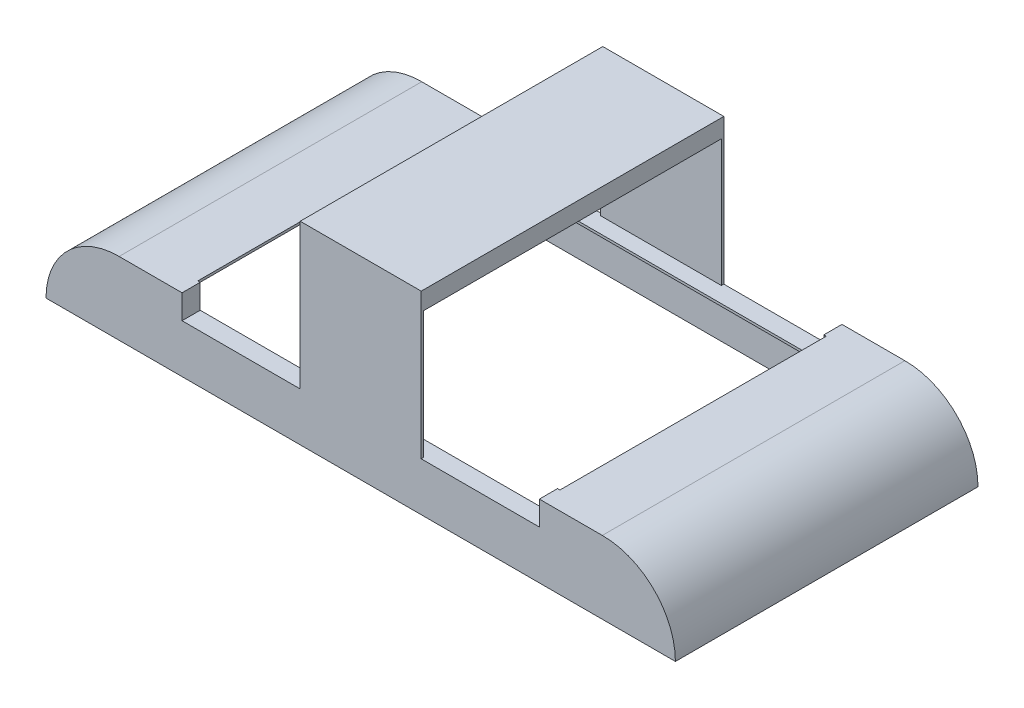
ISO-10303-21;
HEADER;
FILE_DESCRIPTION(('STEP AP214'),'2;1');
FILE_NAME('part.step','',(''),(''),'','','');
FILE_SCHEMA(('AUTOMOTIVE_DESIGN { 1 0 10303 214 1 1 1 1 }'));
ENDSEC;
DATA;
#1=APPLICATION_CONTEXT('core data for automotive mechanical design processes');
#2=APPLICATION_PROTOCOL_DEFINITION('international standard','automotive_design',2000,#1);
#3=PRODUCT_CONTEXT('',#1,'mechanical');
#4=PRODUCT('Part','Part','',(#3));
#5=PRODUCT_RELATED_PRODUCT_CATEGORY('part','',(#4));
#6=PRODUCT_DEFINITION_FORMATION('','',#4);
#7=PRODUCT_DEFINITION_CONTEXT('part definition',#1,'design');
#8=PRODUCT_DEFINITION('design','',#6,#7);
#9=PRODUCT_DEFINITION_SHAPE('','',#8);
#10=(LENGTH_UNIT() NAMED_UNIT(*) SI_UNIT(.MILLI.,.METRE.));
#11=(NAMED_UNIT(*) PLANE_ANGLE_UNIT() SI_UNIT($,.RADIAN.));
#12=(NAMED_UNIT(*) SI_UNIT($,.STERADIAN.) SOLID_ANGLE_UNIT());
#13=UNCERTAINTY_MEASURE_WITH_UNIT(LENGTH_MEASURE(1.E-05),#10,'distance_accuracy_value','');
#14=(GEOMETRIC_REPRESENTATION_CONTEXT(3) GLOBAL_UNCERTAINTY_ASSIGNED_CONTEXT((#13)) GLOBAL_UNIT_ASSIGNED_CONTEXT((#10,
#11,#12)) REPRESENTATION_CONTEXT('',''));
#15=CARTESIAN_POINT('',(0.,0.,0.));
#16=DIRECTION('',(0.,0.,1.));
#17=DIRECTION('',(1.,0.,0.));
#18=AXIS2_PLACEMENT_3D('',#15,#16,#17);
#19=CARTESIAN_POINT('',(110.397345428987,0.,15.));
#20=DIRECTION('',(-1.,0.,0.));
#21=DIRECTION('',(0.,0.,1.));
#22=AXIS2_PLACEMENT_3D('',#19,#20,#21);
#23=PLANE('',#22);
#24=DIRECTION('',(0.,1.,0.));
#25=VECTOR('',#24,1.);
#26=CARTESIAN_POINT('',(110.397345428987,60.,235.));
#27=LINE('',#26,#25);
#28=CARTESIAN_POINT('',(110.397345428987,58.,235.));
#29=VERTEX_POINT('',#28);
#30=CARTESIAN_POINT('',(110.397345428987,60.,235.));
#31=VERTEX_POINT('',#30);
#32=EDGE_CURVE('E284',#29,#31,#27,.T.);
#33=ORIENTED_EDGE('',*,*,#32,.F.);
#34=DIRECTION('',(0.,0.,1.));
#35=VECTOR('',#34,1.);
#36=CARTESIAN_POINT('',(110.397345428987,58.,15.));
#37=LINE('',#36,#35);
#38=CARTESIAN_POINT('',(110.397345428987,58.,15.));
#39=VERTEX_POINT('',#38);
#40=EDGE_CURVE('E404',#39,#29,#37,.T.);
#41=ORIENTED_EDGE('',*,*,#40,.F.);
#42=DIRECTION('',(0.,-1.,0.));
#43=VECTOR('',#42,1.);
#44=CARTESIAN_POINT('',(110.397345428987,40.,15.));
#45=LINE('',#44,#43);
#46=CARTESIAN_POINT('',(110.397345428987,60.,15.));
#47=VERTEX_POINT('',#46);
#48=EDGE_CURVE('E313',#47,#39,#45,.T.);
#49=ORIENTED_EDGE('',*,*,#48,.F.);
#50=DIRECTION('',(0.,0.,1.));
#51=VECTOR('',#50,1.);
#52=CARTESIAN_POINT('',(110.397345428987,60.,15.));
#53=LINE('',#52,#51);
#54=EDGE_CURVE('E440',#47,#31,#53,.T.);
#55=ORIENTED_EDGE('',*,*,#54,.T.);
#56=EDGE_LOOP('',(#33,#41,#49,#55));
#57=FACE_BOUND('',#56,.T.);
#58=ADVANCED_FACE('F33',(#57),#23,.F.);
#59=CARTESIAN_POINT('',(0.,40.,0.));
#60=DIRECTION('',(0.,1.,0.));
#61=DIRECTION('',(0.,0.,1.));
#62=AXIS2_PLACEMENT_3D('',#59,#60,#61);
#63=PLANE('',#62);
#64=DIRECTION('',(0.,0.,1.));
#65=VECTOR('',#64,1.);
#66=CARTESIAN_POINT('',(310.,40.,0.));
#67=LINE('',#66,#65);
#68=CARTESIAN_POINT('',(310.,40.,0.));
#69=VERTEX_POINT('',#68);
#70=CARTESIAN_POINT('',(310.,40.,1.99999999999999));
#71=VERTEX_POINT('',#70);
#72=EDGE_CURVE('E292',#69,#71,#67,.T.);
#73=ORIENTED_EDGE('',*,*,#72,.T.);
#74=DIRECTION('',(1.,0.,0.));
#75=VECTOR('',#74,1.);
#76=CARTESIAN_POINT('',(210.,40.,1.99999999999999));
#77=LINE('',#76,#75);
#78=CARTESIAN_POINT('',(210.,40.,1.99999999999999));
#79=VERTEX_POINT('',#78);
#80=EDGE_CURVE('E267',#79,#71,#77,.T.);
#81=ORIENTED_EDGE('',*,*,#80,.F.);
#82=DIRECTION('',(0.,0.,1.));
#83=VECTOR('',#82,1.);
#84=CARTESIAN_POINT('',(210.,40.,0.));
#85=LINE('',#84,#83);
#86=CARTESIAN_POINT('',(210.,40.,0.));
#87=VERTEX_POINT('',#86);
#88=EDGE_CURVE('E280',#87,#79,#85,.T.);
#89=ORIENTED_EDGE('',*,*,#88,.F.);
#90=DIRECTION('',(-1.,0.,0.));
#91=VECTOR('',#90,1.);
#92=CARTESIAN_POINT('',(409.602654571013,40.,0.));
#93=LINE('',#92,#91);
#94=CARTESIAN_POINT('',(112.397345428987,40.,0.));
#95=VERTEX_POINT('',#94);
#96=EDGE_CURVE('E430',#87,#95,#93,.T.);
#97=ORIENTED_EDGE('',*,*,#96,.T.);
#98=DIRECTION('',(0.,0.,-1.));
#99=VECTOR('',#98,1.);
#100=CARTESIAN_POINT('',(112.397345428987,40.,15.));
#101=LINE('',#100,#99);
#102=CARTESIAN_POINT('',(112.397345428987,40.,15.));
#103=VERTEX_POINT('',#102);
#104=EDGE_CURVE('E316',#103,#95,#101,.T.);
#105=ORIENTED_EDGE('',*,*,#104,.F.);
#106=DIRECTION('',(1.,0.,0.));
#107=VECTOR('',#106,1.);
#108=CARTESIAN_POINT('',(409.602654571013,40.,15.));
#109=LINE('',#108,#107);
#110=CARTESIAN_POINT('',(407.602654571013,40.,15.));
#111=VERTEX_POINT('',#110);
#112=EDGE_CURVE('E442',#103,#111,#109,.T.);
#113=ORIENTED_EDGE('',*,*,#112,.T.);
#114=DIRECTION('',(0.,0.,1.));
#115=VECTOR('',#114,1.);
#116=CARTESIAN_POINT('',(407.602654571013,40.,0.));
#117=LINE('',#116,#115);
#118=CARTESIAN_POINT('',(407.602654571013,40.,0.));
#119=VERTEX_POINT('',#118);
#120=EDGE_CURVE('E347',#119,#111,#117,.T.);
#121=ORIENTED_EDGE('',*,*,#120,.F.);
#122=EDGE_CURVE('E58',#119,#69,#93,.T.);
#123=ORIENTED_EDGE('',*,*,#122,.T.);
#124=EDGE_LOOP('',(#73,#81,#89,#97,#105,#113,#121,#123));
#125=FACE_BOUND('',#124,.T.);
#126=ADVANCED_FACE('F530',(#125),#63,.T.);
#127=CARTESIAN_POINT('',(409.602654571013,0.,15.));
#128=DIRECTION('',(1.,0.,0.));
#129=DIRECTION('',(0.,0.,-1.));
#130=AXIS2_PLACEMENT_3D('',#127,#128,#129);
#131=PLANE('',#130);
#132=DIRECTION('',(0.,-1.,0.));
#133=VECTOR('',#132,1.);
#134=CARTESIAN_POINT('',(409.602654571013,60.,235.));
#135=LINE('',#134,#133);
#136=CARTESIAN_POINT('',(409.602654571013,60.,235.));
#137=VERTEX_POINT('',#136);
#138=CARTESIAN_POINT('',(409.602654571013,58.,235.));
#139=VERTEX_POINT('',#138);
#140=EDGE_CURVE('E328',#137,#139,#135,.T.);
#141=ORIENTED_EDGE('',*,*,#140,.F.);
#142=DIRECTION('',(0.,0.,-1.));
#143=VECTOR('',#142,1.);
#144=CARTESIAN_POINT('',(409.602654571013,60.,15.));
#145=LINE('',#144,#143);
#146=CARTESIAN_POINT('',(409.602654571013,60.,15.));
#147=VERTEX_POINT('',#146);
#148=EDGE_CURVE('E445',#137,#147,#145,.T.);
#149=ORIENTED_EDGE('',*,*,#148,.T.);
#150=DIRECTION('',(0.,1.,0.));
#151=VECTOR('',#150,1.);
#152=CARTESIAN_POINT('',(409.602654571013,60.,15.));
#153=LINE('',#152,#151);
#154=CARTESIAN_POINT('',(409.602654571013,58.,15.));
#155=VERTEX_POINT('',#154);
#156=EDGE_CURVE('E343',#155,#147,#153,.T.);
#157=ORIENTED_EDGE('',*,*,#156,.F.);
#158=DIRECTION('',(0.,0.,-1.));
#159=VECTOR('',#158,1.);
#160=CARTESIAN_POINT('',(409.602654571013,58.,15.));
#161=LINE('',#160,#159);
#162=EDGE_CURVE('E403',#139,#155,#161,.T.);
#163=ORIENTED_EDGE('',*,*,#162,.F.);
#164=EDGE_LOOP('',(#141,#149,#157,#163));
#165=FACE_BOUND('',#164,.T.);
#166=ADVANCED_FACE('F650',(#165),#131,.F.);
#167=CARTESIAN_POINT('',(0.,40.,0.));
#168=DIRECTION('',(0.,1.,0.));
#169=DIRECTION('',(0.,0.,1.));
#170=AXIS2_PLACEMENT_3D('',#167,#168,#169);
#171=PLANE('',#170);
#172=DIRECTION('',(-1.,0.,0.));
#173=VECTOR('',#172,1.);
#174=CARTESIAN_POINT('',(110.397345428987,40.,235.));
#175=LINE('',#174,#173);
#176=CARTESIAN_POINT('',(407.602654571013,40.,235.));
#177=VERTEX_POINT('',#176);
#178=CARTESIAN_POINT('',(112.397345428987,40.,235.));
#179=VERTEX_POINT('',#178);
#180=EDGE_CURVE('E437',#177,#179,#175,.T.);
#181=ORIENTED_EDGE('',*,*,#180,.T.);
#182=DIRECTION('',(0.,0.,-1.));
#183=VECTOR('',#182,1.);
#184=CARTESIAN_POINT('',(112.397345428987,40.,250.));
#185=LINE('',#184,#183);
#186=CARTESIAN_POINT('',(112.397345428987,40.,250.));
#187=VERTEX_POINT('',#186);
#188=EDGE_CURVE('E298',#187,#179,#185,.T.);
#189=ORIENTED_EDGE('',*,*,#188,.F.);
#190=DIRECTION('',(1.,0.,0.));
#191=VECTOR('',#190,1.);
#192=CARTESIAN_POINT('',(110.397345428987,40.,250.));
#193=LINE('',#192,#191);
#194=CARTESIAN_POINT('',(210.,40.,250.));
#195=VERTEX_POINT('',#194);
#196=EDGE_CURVE('E278',#187,#195,#193,.T.);
#197=ORIENTED_EDGE('',*,*,#196,.T.);
#198=CARTESIAN_POINT('',(210.,40.,248.));
#199=VERTEX_POINT('',#198);
#200=EDGE_CURVE('E50',#199,#195,#85,.T.);
#201=ORIENTED_EDGE('',*,*,#200,.F.);
#202=DIRECTION('',(1.,0.,0.));
#203=VECTOR('',#202,1.);
#204=CARTESIAN_POINT('',(210.,40.,248.));
#205=LINE('',#204,#203);
#206=CARTESIAN_POINT('',(310.,40.,248.));
#207=VERTEX_POINT('',#206);
#208=EDGE_CURVE('E259',#199,#207,#205,.T.);
#209=ORIENTED_EDGE('',*,*,#208,.T.);
#210=CARTESIAN_POINT('',(310.,40.,250.));
#211=VERTEX_POINT('',#210);
#212=EDGE_CURVE('E294',#207,#211,#67,.T.);
#213=ORIENTED_EDGE('',*,*,#212,.T.);
#214=CARTESIAN_POINT('',(407.602654571013,40.,250.));
#215=VERTEX_POINT('',#214);
#216=EDGE_CURVE('E438',#211,#215,#193,.T.);
#217=ORIENTED_EDGE('',*,*,#216,.T.);
#218=DIRECTION('',(0.,0.,1.));
#219=VECTOR('',#218,1.);
#220=CARTESIAN_POINT('',(407.602654571013,40.,250.));
#221=LINE('',#220,#219);
#222=EDGE_CURVE('E336',#177,#215,#221,.T.);
#223=ORIENTED_EDGE('',*,*,#222,.F.);
#224=EDGE_LOOP('',(#181,#189,#197,#201,#209,#213,#217,#223));
#225=FACE_BOUND('',#224,.T.);
#226=ADVANCED_FACE('F276',(#225),#171,.T.);
#227=CARTESIAN_POINT('',(0.,0.,250.));
#228=DIRECTION('',(0.,1.,0.));
#229=DIRECTION('',(0.,0.,1.));
#230=AXIS2_PLACEMENT_3D('',#227,#228,#229);
#231=PLANE('',#230);
#232=DIRECTION('',(1.,0.,0.));
#233=VECTOR('',#232,1.);
#234=CARTESIAN_POINT('',(0.,0.,0.));
#235=LINE('',#234,#233);
#236=CARTESIAN_POINT('',(0.,0.,0.));
#237=VERTEX_POINT('',#236);
#238=CARTESIAN_POINT('',(520.,0.,0.));
#239=VERTEX_POINT('',#238);
#240=EDGE_CURVE('E471',#237,#239,#235,.T.);
#241=ORIENTED_EDGE('',*,*,#240,.T.);
#242=DIRECTION('',(0.,0.,-1.));
#243=VECTOR('',#242,1.);
#244=CARTESIAN_POINT('',(520.,0.,250.));
#245=LINE('',#244,#243);
#246=CARTESIAN_POINT('',(520.,0.,250.));
#247=VERTEX_POINT('',#246);
#248=EDGE_CURVE('E481',#247,#239,#245,.T.);
#249=ORIENTED_EDGE('',*,*,#248,.F.);
#250=DIRECTION('',(1.,0.,0.));
#251=VECTOR('',#250,1.);
#252=CARTESIAN_POINT('',(0.,0.,250.));
#253=LINE('',#252,#251);
#254=CARTESIAN_POINT('',(0.,0.,250.));
#255=VERTEX_POINT('',#254);
#256=EDGE_CURVE('E460',#255,#247,#253,.T.);
#257=ORIENTED_EDGE('',*,*,#256,.F.);
#258=DIRECTION('',(0.,0.,-1.));
#259=VECTOR('',#258,1.);
#260=CARTESIAN_POINT('',(0.,0.,250.));
#261=LINE('',#260,#259);
#262=EDGE_CURVE('E37',#255,#237,#261,.T.);
#263=ORIENTED_EDGE('',*,*,#262,.T.);
#264=EDGE_LOOP('',(#241,#249,#257,#263));
#265=FACE_BOUND('',#264,.T.);
#266=DIRECTION('',(1.,0.,0.));
#267=VECTOR('',#266,1.);
#268=CARTESIAN_POINT('',(60.001307039149,0.,2.));
#269=LINE('',#268,#267);
#270=CARTESIAN_POINT('',(2.,0.,2.));
#271=VERTEX_POINT('',#270);
#272=CARTESIAN_POINT('',(518.,0.,2.));
#273=VERTEX_POINT('',#272);
#274=EDGE_CURVE('E378',#271,#273,#269,.T.);
#275=ORIENTED_EDGE('',*,*,#274,.F.);
#276=DIRECTION('',(0.,0.,-1.));
#277=VECTOR('',#276,1.);
#278=CARTESIAN_POINT('',(2.,0.,248.));
#279=LINE('',#278,#277);
#280=CARTESIAN_POINT('',(2.,0.,248.));
#281=VERTEX_POINT('',#280);
#282=EDGE_CURVE('E428',#281,#271,#279,.T.);
#283=ORIENTED_EDGE('',*,*,#282,.F.);
#284=DIRECTION('',(1.,0.,0.));
#285=VECTOR('',#284,1.);
#286=CARTESIAN_POINT('',(60.001307039149,0.,248.));
#287=LINE('',#286,#285);
#288=CARTESIAN_POINT('',(518.,0.,248.));
#289=VERTEX_POINT('',#288);
#290=EDGE_CURVE('E382',#281,#289,#287,.T.);
#291=ORIENTED_EDGE('',*,*,#290,.T.);
#292=DIRECTION('',(0.,0.,-1.));
#293=VECTOR('',#292,1.);
#294=CARTESIAN_POINT('',(518.,0.,248.));
#295=LINE('',#294,#293);
#296=EDGE_CURVE('E394',#289,#273,#295,.T.);
#297=ORIENTED_EDGE('',*,*,#296,.T.);
#298=EDGE_LOOP('',(#275,#283,#291,#297));
#299=FACE_BOUND('',#298,.T.);
#300=ADVANCED_FACE('F490',(#265,#299),#231,.F.);
#301=CARTESIAN_POINT('',(459.602654571013,60.,250.));
#302=DIRECTION('',(0.,-1.,0.));
#303=DIRECTION('',(0.,0.,-1.));
#304=AXIS2_PLACEMENT_3D('',#301,#302,#303);
#305=PLANE('',#304);
#306=DIRECTION('',(-1.,0.,0.));
#307=VECTOR('',#306,1.);
#308=CARTESIAN_POINT('',(459.602654571013,60.,250.));
#309=LINE('',#308,#307);
#310=CARTESIAN_POINT('',(112.397345428987,60.,250.));
#311=VERTEX_POINT('',#310);
#312=CARTESIAN_POINT('',(60.3973454289868,60.,250.));
#313=VERTEX_POINT('',#312);
#314=EDGE_CURVE('E465',#311,#313,#309,.T.);
#315=ORIENTED_EDGE('',*,*,#314,.F.);
#316=DIRECTION('',(0.,0.,1.));
#317=VECTOR('',#316,1.);
#318=CARTESIAN_POINT('',(112.397345428987,60.,250.));
#319=LINE('',#318,#317);
#320=CARTESIAN_POINT('',(112.397345428987,60.,235.));
#321=VERTEX_POINT('',#320);
#322=EDGE_CURVE('E303',#321,#311,#319,.T.);
#323=ORIENTED_EDGE('',*,*,#322,.F.);
#324=DIRECTION('',(-1.,0.,0.));
#325=VECTOR('',#324,1.);
#326=CARTESIAN_POINT('',(112.397345428987,60.,235.));
#327=LINE('',#326,#325);
#328=EDGE_CURVE('E306',#321,#31,#327,.T.);
#329=ORIENTED_EDGE('',*,*,#328,.T.);
#330=ORIENTED_EDGE('',*,*,#54,.F.);
#331=DIRECTION('',(-1.,0.,0.));
#332=VECTOR('',#331,1.);
#333=CARTESIAN_POINT('',(112.397345428987,60.,15.));
#334=LINE('',#333,#332);
#335=CARTESIAN_POINT('',(112.397345428987,60.,15.));
#336=VERTEX_POINT('',#335);
#337=EDGE_CURVE('E324',#336,#47,#334,.T.);
#338=ORIENTED_EDGE('',*,*,#337,.F.);
#339=DIRECTION('',(0.,0.,1.));
#340=VECTOR('',#339,1.);
#341=CARTESIAN_POINT('',(112.397345428987,60.,15.));
#342=LINE('',#341,#340);
#343=CARTESIAN_POINT('',(112.397345428987,60.,0.));
#344=VERTEX_POINT('',#343);
#345=EDGE_CURVE('E322',#344,#336,#342,.T.);
#346=ORIENTED_EDGE('',*,*,#345,.F.);
#347=DIRECTION('',(-1.,0.,0.));
#348=VECTOR('',#347,1.);
#349=CARTESIAN_POINT('',(459.602654571013,60.,0.));
#350=LINE('',#349,#348);
#351=CARTESIAN_POINT('',(60.3973454289868,60.,0.));
#352=VERTEX_POINT('',#351);
#353=EDGE_CURVE('E475',#344,#352,#350,.T.);
#354=ORIENTED_EDGE('',*,*,#353,.T.);
#355=DIRECTION('',(0.,0.,-1.));
#356=VECTOR('',#355,1.);
#357=CARTESIAN_POINT('',(60.3973454289868,60.,250.));
#358=LINE('',#357,#356);
#359=EDGE_CURVE('E468',#313,#352,#358,.T.);
#360=ORIENTED_EDGE('',*,*,#359,.F.);
#361=EDGE_LOOP('',(#315,#323,#329,#330,#338,#346,#354,#360));
#362=FACE_BOUND('',#361,.T.);
#363=ADVANCED_FACE('F517',(#362),#305,.F.);
#364=CARTESIAN_POINT('',(110.397345428987,0.,15.));
#365=DIRECTION('',(0.,0.,-1.));
#366=DIRECTION('',(-1.,0.,0.));
#367=AXIS2_PLACEMENT_3D('',#364,#365,#366);
#368=PLANE('',#367);
#369=DIRECTION('',(0.,1.,0.));
#370=VECTOR('',#369,1.);
#371=CARTESIAN_POINT('',(110.397345428987,0.,15.));
#372=LINE('',#371,#370);
#373=CARTESIAN_POINT('',(110.397345428987,38.,15.));
#374=VERTEX_POINT('',#373);
#375=EDGE_CURVE('E448',#374,#39,#372,.T.);
#376=ORIENTED_EDGE('',*,*,#375,.F.);
#377=DIRECTION('',(1.,0.,0.));
#378=VECTOR('',#377,1.);
#379=CARTESIAN_POINT('',(110.397345428987,38.,15.));
#380=LINE('',#379,#378);
#381=CARTESIAN_POINT('',(409.602654571013,38.,15.));
#382=VERTEX_POINT('',#381);
#383=EDGE_CURVE('E408',#374,#382,#380,.T.);
#384=ORIENTED_EDGE('',*,*,#383,.T.);
#385=DIRECTION('',(0.,1.,0.));
#386=VECTOR('',#385,1.);
#387=CARTESIAN_POINT('',(409.602654571013,0.,15.));
#388=LINE('',#387,#386);
#389=EDGE_CURVE('E451',#382,#155,#388,.T.);
#390=ORIENTED_EDGE('',*,*,#389,.T.);
#391=ORIENTED_EDGE('',*,*,#156,.T.);
#392=DIRECTION('',(1.,0.,0.));
#393=VECTOR('',#392,1.);
#394=CARTESIAN_POINT('',(407.602654571013,60.,15.));
#395=LINE('',#394,#393);
#396=CARTESIAN_POINT('',(407.602654571013,60.,15.));
#397=VERTEX_POINT('',#396);
#398=EDGE_CURVE('E355',#397,#147,#395,.T.);
#399=ORIENTED_EDGE('',*,*,#398,.F.);
#400=DIRECTION('',(0.,1.,0.));
#401=VECTOR('',#400,1.);
#402=CARTESIAN_POINT('',(407.602654571013,60.,15.));
#403=LINE('',#402,#401);
#404=EDGE_CURVE('E350',#111,#397,#403,.T.);
#405=ORIENTED_EDGE('',*,*,#404,.F.);
#406=ORIENTED_EDGE('',*,*,#112,.F.);
#407=DIRECTION('',(0.,-1.,0.));
#408=VECTOR('',#407,1.);
#409=CARTESIAN_POINT('',(112.397345428987,40.,15.));
#410=LINE('',#409,#408);
#411=EDGE_CURVE('E314',#336,#103,#410,.T.);
#412=ORIENTED_EDGE('',*,*,#411,.F.);
#413=ORIENTED_EDGE('',*,*,#337,.T.);
#414=ORIENTED_EDGE('',*,*,#48,.T.);
#415=EDGE_LOOP('',(#376,#384,#390,#391,#399,#405,#406,#412,#413,#414));
#416=FACE_BOUND('',#415,.T.);
#417=ADVANCED_FACE('F629',(#416),#368,.F.);
#418=CARTESIAN_POINT('',(110.397345428987,0.,235.));
#419=DIRECTION('',(0.,0.,1.));
#420=DIRECTION('',(1.,0.,0.));
#421=AXIS2_PLACEMENT_3D('',#418,#419,#420);
#422=PLANE('',#421);
#423=DIRECTION('',(0.,1.,0.));
#424=VECTOR('',#423,1.);
#425=CARTESIAN_POINT('',(409.602654571013,0.,235.));
#426=LINE('',#425,#424);
#427=CARTESIAN_POINT('',(409.602654571013,38.,235.));
#428=VERTEX_POINT('',#427);
#429=EDGE_CURVE('E454',#428,#139,#426,.T.);
#430=ORIENTED_EDGE('',*,*,#429,.F.);
#431=DIRECTION('',(-1.,0.,0.));
#432=VECTOR('',#431,1.);
#433=CARTESIAN_POINT('',(110.397345428987,38.,235.));
#434=LINE('',#433,#432);
#435=CARTESIAN_POINT('',(110.397345428987,38.,235.));
#436=VERTEX_POINT('',#435);
#437=EDGE_CURVE('E409',#428,#436,#434,.T.);
#438=ORIENTED_EDGE('',*,*,#437,.T.);
#439=DIRECTION('',(0.,1.,0.));
#440=VECTOR('',#439,1.);
#441=CARTESIAN_POINT('',(110.397345428987,0.,235.));
#442=LINE('',#441,#440);
#443=EDGE_CURVE('E447',#436,#29,#442,.T.);
#444=ORIENTED_EDGE('',*,*,#443,.T.);
#445=ORIENTED_EDGE('',*,*,#32,.T.);
#446=ORIENTED_EDGE('',*,*,#328,.F.);
#447=DIRECTION('',(0.,1.,0.));
#448=VECTOR('',#447,1.);
#449=CARTESIAN_POINT('',(112.397345428987,60.,235.));
#450=LINE('',#449,#448);
#451=EDGE_CURVE('E301',#179,#321,#450,.T.);
#452=ORIENTED_EDGE('',*,*,#451,.F.);
#453=ORIENTED_EDGE('',*,*,#180,.F.);
#454=DIRECTION('',(0.,-1.,0.));
#455=VECTOR('',#454,1.);
#456=CARTESIAN_POINT('',(407.602654571013,60.,235.));
#457=LINE('',#456,#455);
#458=CARTESIAN_POINT('',(407.602654571013,60.,235.));
#459=VERTEX_POINT('',#458);
#460=EDGE_CURVE('E334',#459,#177,#457,.T.);
#461=ORIENTED_EDGE('',*,*,#460,.F.);
#462=DIRECTION('',(1.,0.,0.));
#463=VECTOR('',#462,1.);
#464=CARTESIAN_POINT('',(407.602654571013,60.,235.));
#465=LINE('',#464,#463);
#466=EDGE_CURVE('E339',#459,#137,#465,.T.);
#467=ORIENTED_EDGE('',*,*,#466,.T.);
#468=ORIENTED_EDGE('',*,*,#140,.T.);
#469=EDGE_LOOP('',(#430,#438,#444,#445,#446,#452,#453,#461,#467,#468));
#470=FACE_BOUND('',#469,.T.);
#471=ADVANCED_FACE('F575',(#470),#422,.F.);
#472=CARTESIAN_POINT('',(60.001307039149,0.,250.));
#473=DIRECTION('',(0.,0.,-1.));
#474=DIRECTION('',(-1.,0.,0.));
#475=AXIS2_PLACEMENT_3D('',#472,#473,#474);
#476=CYLINDRICAL_SURFACE('',#475,60.001307039149);
#477=CARTESIAN_POINT('',(60.001307039149,0.,0.));
#478=DIRECTION('',(0.,0.,1.));
#479=DIRECTION('',(-1.,0.,0.));
#480=AXIS2_PLACEMENT_3D('',#477,#478,#479);
#481=CIRCLE('',#480,60.001307039149);
#482=EDGE_CURVE('E450',#352,#237,#481,.T.);
#483=ORIENTED_EDGE('',*,*,#482,.T.);
#484=ORIENTED_EDGE('',*,*,#262,.F.);
#485=CARTESIAN_POINT('',(60.001307039149,0.,250.));
#486=DIRECTION('',(0.,0.,1.));
#487=DIRECTION('',(-1.,0.,0.));
#488=AXIS2_PLACEMENT_3D('',#485,#486,#487);
#489=CIRCLE('',#488,60.001307039149);
#490=EDGE_CURVE('E457',#313,#255,#489,.T.);
#491=ORIENTED_EDGE('',*,*,#490,.F.);
#492=ORIENTED_EDGE('',*,*,#359,.T.);
#493=EDGE_LOOP('',(#483,#484,#491,#492));
#494=FACE_BOUND('',#493,.T.);
#495=ADVANCED_FACE('F35',(#494),#476,.T.);
#496=CARTESIAN_POINT('',(459.998692960851,0.,250.));
#497=DIRECTION('',(0.,0.,-1.));
#498=DIRECTION('',(-1.,0.,0.));
#499=AXIS2_PLACEMENT_3D('',#496,#497,#498);
#500=CYLINDRICAL_SURFACE('',#499,60.001307039149);
#501=CARTESIAN_POINT('',(459.998692960851,0.,0.));
#502=DIRECTION('',(0.,0.,1.));
#503=DIRECTION('',(1.,0.,0.));
#504=AXIS2_PLACEMENT_3D('',#501,#502,#503);
#505=CIRCLE('',#504,60.001307039149);
#506=CARTESIAN_POINT('',(459.602654571013,60.,0.));
#507=VERTEX_POINT('',#506);
#508=EDGE_CURVE('E473',#239,#507,#505,.T.);
#509=ORIENTED_EDGE('',*,*,#508,.T.);
#510=DIRECTION('',(0.,0.,-1.));
#511=VECTOR('',#510,1.);
#512=CARTESIAN_POINT('',(459.602654571013,60.,250.));
#513=LINE('',#512,#511);
#514=CARTESIAN_POINT('',(459.602654571013,60.,250.));
#515=VERTEX_POINT('',#514);
#516=EDGE_CURVE('E479',#515,#507,#513,.T.);
#517=ORIENTED_EDGE('',*,*,#516,.F.);
#518=CARTESIAN_POINT('',(459.998692960851,0.,250.));
#519=DIRECTION('',(0.,0.,1.));
#520=DIRECTION('',(1.,0.,0.));
#521=AXIS2_PLACEMENT_3D('',#518,#519,#520);
#522=CIRCLE('',#521,60.001307039149);
#523=EDGE_CURVE('E463',#247,#515,#522,.T.);
#524=ORIENTED_EDGE('',*,*,#523,.F.);
#525=ORIENTED_EDGE('',*,*,#248,.T.);
#526=EDGE_LOOP('',(#509,#517,#524,#525));
#527=FACE_BOUND('',#526,.T.);
#528=ADVANCED_FACE('F502',(#527),#500,.T.);
#529=ORIENTED_EDGE('',*,*,#148,.F.);
#530=ORIENTED_EDGE('',*,*,#466,.F.);
#531=DIRECTION('',(0.,0.,-1.));
#532=VECTOR('',#531,1.);
#533=CARTESIAN_POINT('',(407.602654571013,60.,250.));
#534=LINE('',#533,#532);
#535=CARTESIAN_POINT('',(407.602654571013,60.,250.));
#536=VERTEX_POINT('',#535);
#537=EDGE_CURVE('E332',#536,#459,#534,.T.);
#538=ORIENTED_EDGE('',*,*,#537,.F.);
#539=EDGE_CURVE('E466',#515,#536,#309,.T.);
#540=ORIENTED_EDGE('',*,*,#539,.F.);
#541=ORIENTED_EDGE('',*,*,#516,.T.);
#542=CARTESIAN_POINT('',(407.602654571013,60.,0.));
#543=VERTEX_POINT('',#542);
#544=EDGE_CURVE('E461',#507,#543,#350,.T.);
#545=ORIENTED_EDGE('',*,*,#544,.T.);
#546=DIRECTION('',(0.,0.,-1.));
#547=VECTOR('',#546,1.);
#548=CARTESIAN_POINT('',(407.602654571013,60.,0.));
#549=LINE('',#548,#547);
#550=EDGE_CURVE('E352',#397,#543,#549,.T.);
#551=ORIENTED_EDGE('',*,*,#550,.F.);
#552=ORIENTED_EDGE('',*,*,#398,.T.);
#553=EDGE_LOOP('',(#529,#530,#538,#540,#541,#545,#551,#552));
#554=FACE_BOUND('',#553,.T.);
#555=ADVANCED_FACE('F506',(#554),#305,.F.);
#556=CARTESIAN_POINT('',(60.001307039149,0.,250.));
#557=DIRECTION('',(0.,0.,-1.));
#558=DIRECTION('',(-1.,0.,0.));
#559=AXIS2_PLACEMENT_3D('',#556,#557,#558);
#560=PLANE('',#559);
#561=ORIENTED_EDGE('',*,*,#196,.F.);
#562=DIRECTION('',(0.,-1.,0.));
#563=VECTOR('',#562,1.);
#564=CARTESIAN_POINT('',(112.397345428987,60.,250.));
#565=LINE('',#564,#563);
#566=EDGE_CURVE('E295',#311,#187,#565,.T.);
#567=ORIENTED_EDGE('',*,*,#566,.F.);
#568=ORIENTED_EDGE('',*,*,#314,.T.);
#569=ORIENTED_EDGE('',*,*,#490,.T.);
#570=ORIENTED_EDGE('',*,*,#256,.T.);
#571=ORIENTED_EDGE('',*,*,#523,.T.);
#572=ORIENTED_EDGE('',*,*,#539,.T.);
#573=DIRECTION('',(0.,1.,0.));
#574=VECTOR('',#573,1.);
#575=CARTESIAN_POINT('',(407.602654571013,60.,250.));
#576=LINE('',#575,#574);
#577=EDGE_CURVE('E329',#215,#536,#576,.T.);
#578=ORIENTED_EDGE('',*,*,#577,.F.);
#579=ORIENTED_EDGE('',*,*,#216,.F.);
#580=DIRECTION('',(0.,1.,0.));
#581=VECTOR('',#580,1.);
#582=CARTESIAN_POINT('',(310.,160.,250.));
#583=LINE('',#582,#581);
#584=CARTESIAN_POINT('',(310.,160.,250.));
#585=VERTEX_POINT('',#584);
#586=EDGE_CURVE('E539',#211,#585,#583,.T.);
#587=ORIENTED_EDGE('',*,*,#586,.T.);
#588=DIRECTION('',(-1.,0.,0.));
#589=VECTOR('',#588,1.);
#590=CARTESIAN_POINT('',(210.,160.,250.));
#591=LINE('',#590,#589);
#592=CARTESIAN_POINT('',(210.,160.,250.));
#593=VERTEX_POINT('',#592);
#594=EDGE_CURVE('E541',#585,#593,#591,.T.);
#595=ORIENTED_EDGE('',*,*,#594,.T.);
#596=DIRECTION('',(0.,-1.,0.));
#597=VECTOR('',#596,1.);
#598=CARTESIAN_POINT('',(210.,40.,250.));
#599=LINE('',#598,#597);
#600=EDGE_CURVE('E288',#593,#195,#599,.T.);
#601=ORIENTED_EDGE('',*,*,#600,.T.);
#602=EDGE_LOOP('',(#561,#567,#568,#569,#570,#571,#572,#578,#579,#587,#595,#601));
#603=FACE_BOUND('',#602,.T.);
#604=ADVANCED_FACE('F512',(#603),#560,.F.);
#605=CARTESIAN_POINT('',(60.001307039149,0.,0.));
#606=DIRECTION('',(0.,0.,-1.));
#607=DIRECTION('',(-1.,0.,0.));
#608=AXIS2_PLACEMENT_3D('',#605,#606,#607);
#609=PLANE('',#608);
#610=ORIENTED_EDGE('',*,*,#353,.F.);
#611=DIRECTION('',(0.,1.,0.));
#612=VECTOR('',#611,1.);
#613=CARTESIAN_POINT('',(112.397345428987,40.,0.));
#614=LINE('',#613,#612);
#615=EDGE_CURVE('E319',#95,#344,#614,.T.);
#616=ORIENTED_EDGE('',*,*,#615,.F.);
#617=ORIENTED_EDGE('',*,*,#96,.F.);
#618=DIRECTION('',(0.,-1.,0.));
#619=VECTOR('',#618,1.);
#620=CARTESIAN_POINT('',(210.,40.,0.));
#621=LINE('',#620,#619);
#622=CARTESIAN_POINT('',(210.,160.,0.));
#623=VERTEX_POINT('',#622);
#624=EDGE_CURVE('E529',#623,#87,#621,.T.);
#625=ORIENTED_EDGE('',*,*,#624,.F.);
#626=DIRECTION('',(-1.,0.,0.));
#627=VECTOR('',#626,1.);
#628=CARTESIAN_POINT('',(210.,160.,0.));
#629=LINE('',#628,#627);
#630=CARTESIAN_POINT('',(310.,160.,0.));
#631=VERTEX_POINT('',#630);
#632=EDGE_CURVE('E533',#631,#623,#629,.T.);
#633=ORIENTED_EDGE('',*,*,#632,.F.);
#634=DIRECTION('',(0.,1.,0.));
#635=VECTOR('',#634,1.);
#636=CARTESIAN_POINT('',(310.,160.,0.));
#637=LINE('',#636,#635);
#638=EDGE_CURVE('E535',#69,#631,#637,.T.);
#639=ORIENTED_EDGE('',*,*,#638,.F.);
#640=ORIENTED_EDGE('',*,*,#122,.F.);
#641=DIRECTION('',(0.,-1.,0.));
#642=VECTOR('',#641,1.);
#643=CARTESIAN_POINT('',(407.602654571013,60.,0.));
#644=LINE('',#643,#642);
#645=EDGE_CURVE('E344',#543,#119,#644,.T.);
#646=ORIENTED_EDGE('',*,*,#645,.F.);
#647=ORIENTED_EDGE('',*,*,#544,.F.);
#648=ORIENTED_EDGE('',*,*,#508,.F.);
#649=ORIENTED_EDGE('',*,*,#240,.F.);
#650=ORIENTED_EDGE('',*,*,#482,.F.);
#651=EDGE_LOOP('',(#610,#616,#617,#625,#633,#639,#640,#646,#647,#648,#649,#650));
#652=FACE_BOUND('',#651,.T.);
#653=ADVANCED_FACE('F497',(#652),#609,.T.);
#654=CARTESIAN_POINT('',(110.397345428987,0.,15.));
#655=DIRECTION('',(-1.,0.,0.));
#656=DIRECTION('',(0.,0.,1.));
#657=AXIS2_PLACEMENT_3D('',#654,#655,#656);
#658=PLANE('',#657);
#659=ORIENTED_EDGE('',*,*,#375,.T.);
#660=CARTESIAN_POINT('',(110.397345428987,58.,2.));
#661=VERTEX_POINT('',#660);
#662=EDGE_CURVE('E401',#661,#39,#37,.T.);
#663=ORIENTED_EDGE('',*,*,#662,.F.);
#664=DIRECTION('',(0.,1.,0.));
#665=VECTOR('',#664,1.);
#666=CARTESIAN_POINT('',(110.397345428987,0.,2.));
#667=LINE('',#666,#665);
#668=CARTESIAN_POINT('',(110.397345428987,38.,2.));
#669=VERTEX_POINT('',#668);
#670=EDGE_CURVE('E42',#669,#661,#667,.T.);
#671=ORIENTED_EDGE('',*,*,#670,.F.);
#672=DIRECTION('',(0.,0.,1.));
#673=VECTOR('',#672,1.);
#674=CARTESIAN_POINT('',(110.397345428987,38.,0.));
#675=LINE('',#674,#673);
#676=EDGE_CURVE('E400',#669,#374,#675,.T.);
#677=ORIENTED_EDGE('',*,*,#676,.T.);
#678=EDGE_LOOP('',(#659,#663,#671,#677));
#679=FACE_BOUND('',#678,.T.);
#680=ADVANCED_FACE('F626',(#679),#658,.T.);
#681=CARTESIAN_POINT('',(409.602654571013,0.,15.));
#682=DIRECTION('',(1.,0.,0.));
#683=DIRECTION('',(0.,0.,-1.));
#684=AXIS2_PLACEMENT_3D('',#681,#682,#683);
#685=PLANE('',#684);
#686=ORIENTED_EDGE('',*,*,#429,.T.);
#687=CARTESIAN_POINT('',(409.602654571013,58.,248.));
#688=VERTEX_POINT('',#687);
#689=EDGE_CURVE('E379',#688,#139,#161,.T.);
#690=ORIENTED_EDGE('',*,*,#689,.F.);
#691=DIRECTION('',(0.,1.,0.));
#692=VECTOR('',#691,1.);
#693=CARTESIAN_POINT('',(409.602654571013,0.,248.));
#694=LINE('',#693,#692);
#695=CARTESIAN_POINT('',(409.602654571013,38.,248.));
#696=VERTEX_POINT('',#695);
#697=EDGE_CURVE('E413',#696,#688,#694,.T.);
#698=ORIENTED_EDGE('',*,*,#697,.F.);
#699=DIRECTION('',(0.,0.,-1.));
#700=VECTOR('',#699,1.);
#701=CARTESIAN_POINT('',(409.602654571013,38.,0.));
#702=LINE('',#701,#700);
#703=EDGE_CURVE('E386',#696,#428,#702,.T.);
#704=ORIENTED_EDGE('',*,*,#703,.T.);
#705=EDGE_LOOP('',(#686,#690,#698,#704));
#706=FACE_BOUND('',#705,.T.);
#707=ADVANCED_FACE('F709',(#706),#685,.T.);
#708=CARTESIAN_POINT('',(459.602654571013,58.,250.));
#709=DIRECTION('',(0.,-1.,0.));
#710=DIRECTION('',(0.,0.,-1.));
#711=AXIS2_PLACEMENT_3D('',#708,#709,#710);
#712=PLANE('',#711);
#713=DIRECTION('',(-1.,0.,0.));
#714=VECTOR('',#713,1.);
#715=CARTESIAN_POINT('',(60.001307039149,58.,248.));
#716=LINE('',#715,#714);
#717=CARTESIAN_POINT('',(110.397345428987,58.,248.));
#718=VERTEX_POINT('',#717);
#719=CARTESIAN_POINT('',(60.390688920636,58.,248.));
#720=VERTEX_POINT('',#719);
#721=EDGE_CURVE('E363',#718,#720,#716,.T.);
#722=ORIENTED_EDGE('',*,*,#721,.T.);
#723=DIRECTION('',(0.,0.,-1.));
#724=VECTOR('',#723,1.);
#725=CARTESIAN_POINT('',(60.390688920636,58.,248.));
#726=LINE('',#725,#724);
#727=CARTESIAN_POINT('',(60.390688920636,58.,2.));
#728=VERTEX_POINT('',#727);
#729=EDGE_CURVE('E371',#720,#728,#726,.T.);
#730=ORIENTED_EDGE('',*,*,#729,.T.);
#731=DIRECTION('',(-1.,0.,0.));
#732=VECTOR('',#731,1.);
#733=CARTESIAN_POINT('',(60.001307039149,58.,2.));
#734=LINE('',#733,#732);
#735=EDGE_CURVE('E367',#661,#728,#734,.T.);
#736=ORIENTED_EDGE('',*,*,#735,.F.);
#737=ORIENTED_EDGE('',*,*,#662,.T.);
#738=ORIENTED_EDGE('',*,*,#40,.T.);
#739=DIRECTION('',(0.,0.,1.));
#740=VECTOR('',#739,1.);
#741=CARTESIAN_POINT('',(110.397345428987,58.,250.));
#742=LINE('',#741,#740);
#743=EDGE_CURVE('E311',#29,#718,#742,.T.);
#744=ORIENTED_EDGE('',*,*,#743,.T.);
#745=EDGE_LOOP('',(#722,#730,#736,#737,#738,#744));
#746=FACE_BOUND('',#745,.T.);
#747=ADVANCED_FACE('F588',(#746),#712,.T.);
#748=CARTESIAN_POINT('',(60.001307039149,0.,250.));
#749=DIRECTION('',(0.,0.,-1.));
#750=DIRECTION('',(-1.,0.,0.));
#751=AXIS2_PLACEMENT_3D('',#748,#749,#750);
#752=CYLINDRICAL_SURFACE('',#751,58.001307039149);
#753=CARTESIAN_POINT('',(60.001307039149,0.,2.));
#754=DIRECTION('',(0.,0.,-1.));
#755=DIRECTION('',(-1.,0.,0.));
#756=AXIS2_PLACEMENT_3D('',#753,#754,#755);
#757=CIRCLE('',#756,58.001307039149);
#758=EDGE_CURVE('E375',#728,#271,#757,.F.);
#759=ORIENTED_EDGE('',*,*,#758,.F.);
#760=ORIENTED_EDGE('',*,*,#729,.F.);
#761=CARTESIAN_POINT('',(60.001307039149,0.,248.));
#762=DIRECTION('',(0.,0.,-1.));
#763=DIRECTION('',(-1.,0.,0.));
#764=AXIS2_PLACEMENT_3D('',#761,#762,#763);
#765=CIRCLE('',#764,58.001307039149);
#766=EDGE_CURVE('E380',#720,#281,#765,.F.);
#767=ORIENTED_EDGE('',*,*,#766,.T.);
#768=ORIENTED_EDGE('',*,*,#282,.T.);
#769=EDGE_LOOP('',(#759,#760,#767,#768));
#770=FACE_BOUND('',#769,.T.);
#771=ADVANCED_FACE('F602',(#770),#752,.F.);
#772=CARTESIAN_POINT('',(459.998692960851,0.,250.));
#773=DIRECTION('',(0.,0.,-1.));
#774=DIRECTION('',(-1.,0.,0.));
#775=AXIS2_PLACEMENT_3D('',#772,#773,#774);
#776=CYLINDRICAL_SURFACE('',#775,58.001307039149);
#777=CARTESIAN_POINT('',(459.998692960851,0.,2.));
#778=DIRECTION('',(0.,0.,-1.));
#779=DIRECTION('',(-1.,0.,0.));
#780=AXIS2_PLACEMENT_3D('',#777,#778,#779);
#781=CIRCLE('',#780,58.001307039149);
#782=CARTESIAN_POINT('',(459.609311079363,58.,2.));
#783=VERTEX_POINT('',#782);
#784=EDGE_CURVE('E370',#273,#783,#781,.F.);
#785=ORIENTED_EDGE('',*,*,#784,.F.);
#786=ORIENTED_EDGE('',*,*,#296,.F.);
#787=CARTESIAN_POINT('',(459.998692960851,0.,248.));
#788=DIRECTION('',(0.,0.,-1.));
#789=DIRECTION('',(-1.,0.,0.));
#790=AXIS2_PLACEMENT_3D('',#787,#788,#789);
#791=CIRCLE('',#790,58.001307039149);
#792=CARTESIAN_POINT('',(459.609311079363,58.,248.));
#793=VERTEX_POINT('',#792);
#794=EDGE_CURVE('E366',#289,#793,#791,.F.);
#795=ORIENTED_EDGE('',*,*,#794,.T.);
#796=DIRECTION('',(0.,0.,-1.));
#797=VECTOR('',#796,1.);
#798=CARTESIAN_POINT('',(459.609311079363,58.,248.));
#799=LINE('',#798,#797);
#800=EDGE_CURVE('E374',#793,#783,#799,.T.);
#801=ORIENTED_EDGE('',*,*,#800,.T.);
#802=EDGE_LOOP('',(#785,#786,#795,#801));
#803=FACE_BOUND('',#802,.T.);
#804=ADVANCED_FACE('F610',(#803),#776,.F.);
#805=ORIENTED_EDGE('',*,*,#689,.T.);
#806=ORIENTED_EDGE('',*,*,#162,.T.);
#807=DIRECTION('',(0.,0.,-1.));
#808=VECTOR('',#807,1.);
#809=CARTESIAN_POINT('',(409.602654571013,58.,250.));
#810=LINE('',#809,#808);
#811=CARTESIAN_POINT('',(409.602654571013,58.,2.));
#812=VERTEX_POINT('',#811);
#813=EDGE_CURVE('E360',#155,#812,#810,.T.);
#814=ORIENTED_EDGE('',*,*,#813,.T.);
#815=DIRECTION('',(-1.,0.,0.));
#816=VECTOR('',#815,1.);
#817=CARTESIAN_POINT('',(60.001307039149,58.,2.));
#818=LINE('',#817,#816);
#819=EDGE_CURVE('E369',#783,#812,#818,.T.);
#820=ORIENTED_EDGE('',*,*,#819,.F.);
#821=ORIENTED_EDGE('',*,*,#800,.F.);
#822=DIRECTION('',(-1.,0.,0.));
#823=VECTOR('',#822,1.);
#824=CARTESIAN_POINT('',(60.001307039149,58.,248.));
#825=LINE('',#824,#823);
#826=EDGE_CURVE('E365',#793,#688,#825,.T.);
#827=ORIENTED_EDGE('',*,*,#826,.T.);
#828=EDGE_LOOP('',(#805,#806,#814,#820,#821,#827));
#829=FACE_BOUND('',#828,.T.);
#830=ADVANCED_FACE('F614',(#829),#712,.T.);
#831=CARTESIAN_POINT('',(60.001307039149,0.,248.));
#832=DIRECTION('',(0.,0.,-1.));
#833=DIRECTION('',(-1.,0.,0.));
#834=AXIS2_PLACEMENT_3D('',#831,#832,#833);
#835=PLANE('',#834);
#836=DIRECTION('',(1.,0.,0.));
#837=VECTOR('',#836,1.);
#838=CARTESIAN_POINT('',(60.001307039149,38.,248.));
#839=LINE('',#838,#837);
#840=CARTESIAN_POINT('',(110.397345428987,38.,248.));
#841=VERTEX_POINT('',#840);
#842=EDGE_CURVE('E383',#841,#696,#839,.T.);
#843=ORIENTED_EDGE('',*,*,#842,.T.);
#844=ORIENTED_EDGE('',*,*,#697,.T.);
#845=ORIENTED_EDGE('',*,*,#826,.F.);
#846=ORIENTED_EDGE('',*,*,#794,.F.);
#847=ORIENTED_EDGE('',*,*,#290,.F.);
#848=ORIENTED_EDGE('',*,*,#766,.F.);
#849=ORIENTED_EDGE('',*,*,#721,.F.);
#850=DIRECTION('',(0.,1.,0.));
#851=VECTOR('',#850,1.);
#852=CARTESIAN_POINT('',(110.397345428987,0.,248.));
#853=LINE('',#852,#851);
#854=EDGE_CURVE('E11',#841,#718,#853,.T.);
#855=ORIENTED_EDGE('',*,*,#854,.F.);
#856=EDGE_LOOP('',(#843,#844,#845,#846,#847,#848,#849,#855));
#857=FACE_BOUND('',#856,.T.);
#858=ADVANCED_FACE('F596',(#857),#835,.T.);
#859=CARTESIAN_POINT('',(60.001307039149,0.,2.));
#860=DIRECTION('',(0.,0.,-1.));
#861=DIRECTION('',(-1.,0.,0.));
#862=AXIS2_PLACEMENT_3D('',#859,#860,#861);
#863=PLANE('',#862);
#864=DIRECTION('',(0.,1.,0.));
#865=VECTOR('',#864,1.);
#866=CARTESIAN_POINT('',(409.602654571013,0.,2.));
#867=LINE('',#866,#865);
#868=CARTESIAN_POINT('',(409.602654571013,38.,2.));
#869=VERTEX_POINT('',#868);
#870=EDGE_CURVE('E416',#869,#812,#867,.T.);
#871=ORIENTED_EDGE('',*,*,#870,.F.);
#872=DIRECTION('',(-1.,0.,0.));
#873=VECTOR('',#872,1.);
#874=CARTESIAN_POINT('',(0.,38.,2.));
#875=LINE('',#874,#873);
#876=EDGE_CURVE('E397',#869,#669,#875,.T.);
#877=ORIENTED_EDGE('',*,*,#876,.T.);
#878=ORIENTED_EDGE('',*,*,#670,.T.);
#879=ORIENTED_EDGE('',*,*,#735,.T.);
#880=ORIENTED_EDGE('',*,*,#758,.T.);
#881=ORIENTED_EDGE('',*,*,#274,.T.);
#882=ORIENTED_EDGE('',*,*,#784,.T.);
#883=ORIENTED_EDGE('',*,*,#819,.T.);
#884=EDGE_LOOP('',(#871,#877,#878,#879,#880,#881,#882,#883));
#885=FACE_BOUND('',#884,.T.);
#886=ADVANCED_FACE('F606',(#885),#863,.F.);
#887=ORIENTED_EDGE('',*,*,#443,.F.);
#888=DIRECTION('',(0.,0.,1.));
#889=VECTOR('',#888,1.);
#890=CARTESIAN_POINT('',(110.397345428987,38.,0.));
#891=LINE('',#890,#889);
#892=EDGE_CURVE('E387',#436,#841,#891,.T.);
#893=ORIENTED_EDGE('',*,*,#892,.T.);
#894=ORIENTED_EDGE('',*,*,#854,.T.);
#895=ORIENTED_EDGE('',*,*,#743,.F.);
#896=EDGE_LOOP('',(#887,#893,#894,#895));
#897=FACE_BOUND('',#896,.T.);
#898=ADVANCED_FACE('F592',(#897),#658,.T.);
#899=ORIENTED_EDGE('',*,*,#389,.F.);
#900=DIRECTION('',(0.,0.,-1.));
#901=VECTOR('',#900,1.);
#902=CARTESIAN_POINT('',(409.602654571013,38.,0.));
#903=LINE('',#902,#901);
#904=EDGE_CURVE('E362',#382,#869,#903,.T.);
#905=ORIENTED_EDGE('',*,*,#904,.T.);
#906=ORIENTED_EDGE('',*,*,#870,.T.);
#907=ORIENTED_EDGE('',*,*,#813,.F.);
#908=EDGE_LOOP('',(#899,#905,#906,#907));
#909=FACE_BOUND('',#908,.T.);
#910=ADVANCED_FACE('F618',(#909),#685,.T.);
#911=CARTESIAN_POINT('',(0.,38.,0.));
#912=DIRECTION('',(0.,1.,0.));
#913=DIRECTION('',(0.,0.,1.));
#914=AXIS2_PLACEMENT_3D('',#911,#912,#913);
#915=PLANE('',#914);
#916=ORIENTED_EDGE('',*,*,#892,.F.);
#917=ORIENTED_EDGE('',*,*,#437,.F.);
#918=ORIENTED_EDGE('',*,*,#703,.F.);
#919=ORIENTED_EDGE('',*,*,#842,.F.);
#920=EDGE_LOOP('',(#916,#917,#918,#919));
#921=FACE_BOUND('',#920,.T.);
#922=ADVANCED_FACE('F765',(#921),#915,.F.);
#923=CARTESIAN_POINT('',(0.,38.,0.));
#924=DIRECTION('',(0.,1.,0.));
#925=DIRECTION('',(0.,0.,1.));
#926=AXIS2_PLACEMENT_3D('',#923,#924,#925);
#927=PLANE('',#926);
#928=ORIENTED_EDGE('',*,*,#904,.F.);
#929=ORIENTED_EDGE('',*,*,#383,.F.);
#930=ORIENTED_EDGE('',*,*,#676,.F.);
#931=ORIENTED_EDGE('',*,*,#876,.F.);
#932=EDGE_LOOP('',(#928,#929,#930,#931));
#933=FACE_BOUND('',#932,.T.);
#934=ADVANCED_FACE('F624',(#933),#927,.F.);
#935=CARTESIAN_POINT('',(407.602654571013,0.,0.));
#936=DIRECTION('',(-1.,0.,0.));
#937=DIRECTION('',(0.,0.,1.));
#938=AXIS2_PLACEMENT_3D('',#935,#936,#937);
#939=PLANE('',#938);
#940=ORIENTED_EDGE('',*,*,#645,.T.);
#941=ORIENTED_EDGE('',*,*,#120,.T.);
#942=ORIENTED_EDGE('',*,*,#404,.T.);
#943=ORIENTED_EDGE('',*,*,#550,.T.);
#944=EDGE_LOOP('',(#940,#941,#942,#943));
#945=FACE_BOUND('',#944,.T.);
#946=ADVANCED_FACE('F634',(#945),#939,.T.);
#947=CARTESIAN_POINT('',(407.602654571013,0.,0.));
#948=DIRECTION('',(1.,0.,0.));
#949=DIRECTION('',(0.,0.,-1.));
#950=AXIS2_PLACEMENT_3D('',#947,#948,#949);
#951=PLANE('',#950);
#952=ORIENTED_EDGE('',*,*,#577,.T.);
#953=ORIENTED_EDGE('',*,*,#537,.T.);
#954=ORIENTED_EDGE('',*,*,#460,.T.);
#955=ORIENTED_EDGE('',*,*,#222,.T.);
#956=EDGE_LOOP('',(#952,#953,#954,#955));
#957=FACE_BOUND('',#956,.T.);
#958=ADVANCED_FACE('F571',(#957),#951,.F.);
#959=CARTESIAN_POINT('',(112.397345428987,0.,0.));
#960=DIRECTION('',(-1.,0.,0.));
#961=DIRECTION('',(0.,0.,1.));
#962=AXIS2_PLACEMENT_3D('',#959,#960,#961);
#963=PLANE('',#962);
#964=ORIENTED_EDGE('',*,*,#411,.T.);
#965=ORIENTED_EDGE('',*,*,#104,.T.);
#966=ORIENTED_EDGE('',*,*,#615,.T.);
#967=ORIENTED_EDGE('',*,*,#345,.T.);
#968=EDGE_LOOP('',(#964,#965,#966,#967));
#969=FACE_BOUND('',#968,.T.);
#970=ADVANCED_FACE('F523',(#969),#963,.F.);
#971=CARTESIAN_POINT('',(112.397345428987,0.,0.));
#972=DIRECTION('',(1.,0.,0.));
#973=DIRECTION('',(0.,0.,-1.));
#974=AXIS2_PLACEMENT_3D('',#971,#972,#973);
#975=PLANE('',#974);
#976=ORIENTED_EDGE('',*,*,#566,.T.);
#977=ORIENTED_EDGE('',*,*,#188,.T.);
#978=ORIENTED_EDGE('',*,*,#451,.T.);
#979=ORIENTED_EDGE('',*,*,#322,.T.);
#980=EDGE_LOOP('',(#976,#977,#978,#979));
#981=FACE_BOUND('',#980,.T.);
#982=ADVANCED_FACE('F580',(#981),#975,.T.);
#983=CARTESIAN_POINT('',(210.,40.,0.));
#984=DIRECTION('',(-1.,0.,0.));
#985=DIRECTION('',(0.,0.,1.));
#986=AXIS2_PLACEMENT_3D('',#983,#984,#985);
#987=PLANE('',#986);
#988=DIRECTION('',(0.,-1.,0.));
#989=VECTOR('',#988,1.);
#990=CARTESIAN_POINT('',(210.,145.,248.));
#991=LINE('',#990,#989);
#992=CARTESIAN_POINT('',(210.,145.,248.));
#993=VERTEX_POINT('',#992);
#994=EDGE_CURVE('E261',#993,#199,#991,.T.);
#995=ORIENTED_EDGE('',*,*,#994,.T.);
#996=ORIENTED_EDGE('',*,*,#200,.T.);
#997=ORIENTED_EDGE('',*,*,#600,.F.);
#998=DIRECTION('',(0.,0.,1.));
#999=VECTOR('',#998,1.);
#1000=CARTESIAN_POINT('',(210.,160.,0.));
#1001=LINE('',#1000,#999);
#1002=EDGE_CURVE('E281',#623,#593,#1001,.T.);
#1003=ORIENTED_EDGE('',*,*,#1002,.F.);
#1004=ORIENTED_EDGE('',*,*,#624,.T.);
#1005=ORIENTED_EDGE('',*,*,#88,.T.);
#1006=DIRECTION('',(0.,1.,0.));
#1007=VECTOR('',#1006,1.);
#1008=CARTESIAN_POINT('',(210.,145.,2.));
#1009=LINE('',#1008,#1007);
#1010=CARTESIAN_POINT('',(210.,145.,2.));
#1011=VERTEX_POINT('',#1010);
#1012=EDGE_CURVE('E273',#79,#1011,#1009,.T.);
#1013=ORIENTED_EDGE('',*,*,#1012,.T.);
#1014=DIRECTION('',(0.,0.,1.));
#1015=VECTOR('',#1014,1.);
#1016=CARTESIAN_POINT('',(210.,145.,248.));
#1017=LINE('',#1016,#1015);
#1018=EDGE_CURVE('E268',#1011,#993,#1017,.T.);
#1019=ORIENTED_EDGE('',*,*,#1018,.T.);
#1020=EDGE_LOOP('',(#995,#996,#997,#1003,#1004,#1005,#1013,#1019));
#1021=FACE_BOUND('',#1020,.T.);
#1022=ADVANCED_FACE('F270',(#1021),#987,.T.);
#1023=CARTESIAN_POINT('',(210.,160.,0.));
#1024=DIRECTION('',(0.,1.,0.));
#1025=DIRECTION('',(0.,0.,1.));
#1026=AXIS2_PLACEMENT_3D('',#1023,#1024,#1025);
#1027=PLANE('',#1026);
#1028=ORIENTED_EDGE('',*,*,#594,.F.);
#1029=DIRECTION('',(0.,0.,1.));
#1030=VECTOR('',#1029,1.);
#1031=CARTESIAN_POINT('',(310.,160.,0.));
#1032=LINE('',#1031,#1030);
#1033=EDGE_CURVE('E285',#631,#585,#1032,.T.);
#1034=ORIENTED_EDGE('',*,*,#1033,.F.);
#1035=ORIENTED_EDGE('',*,*,#632,.T.);
#1036=ORIENTED_EDGE('',*,*,#1002,.T.);
#1037=EDGE_LOOP('',(#1028,#1034,#1035,#1036));
#1038=FACE_BOUND('',#1037,.T.);
#1039=ADVANCED_FACE('F636',(#1038),#1027,.T.);
#1040=CARTESIAN_POINT('',(310.,160.,0.));
#1041=DIRECTION('',(1.,0.,0.));
#1042=DIRECTION('',(0.,0.,-1.));
#1043=AXIS2_PLACEMENT_3D('',#1040,#1041,#1042);
#1044=PLANE('',#1043);
#1045=DIRECTION('',(0.,-1.,0.));
#1046=VECTOR('',#1045,1.);
#1047=CARTESIAN_POINT('',(310.,145.,248.));
#1048=LINE('',#1047,#1046);
#1049=CARTESIAN_POINT('',(310.,145.,248.));
#1050=VERTEX_POINT('',#1049);
#1051=EDGE_CURVE('E264',#1050,#207,#1048,.T.);
#1052=ORIENTED_EDGE('',*,*,#1051,.F.);
#1053=DIRECTION('',(0.,0.,1.));
#1054=VECTOR('',#1053,1.);
#1055=CARTESIAN_POINT('',(310.,145.,248.));
#1056=LINE('',#1055,#1054);
#1057=CARTESIAN_POINT('',(310.,145.,2.));
#1058=VERTEX_POINT('',#1057);
#1059=EDGE_CURVE('E274',#1058,#1050,#1056,.T.);
#1060=ORIENTED_EDGE('',*,*,#1059,.F.);
#1061=DIRECTION('',(0.,1.,0.));
#1062=VECTOR('',#1061,1.);
#1063=CARTESIAN_POINT('',(310.,145.,2.));
#1064=LINE('',#1063,#1062);
#1065=EDGE_CURVE('E555',#71,#1058,#1064,.T.);
#1066=ORIENTED_EDGE('',*,*,#1065,.F.);
#1067=ORIENTED_EDGE('',*,*,#72,.F.);
#1068=ORIENTED_EDGE('',*,*,#638,.T.);
#1069=ORIENTED_EDGE('',*,*,#1033,.T.);
#1070=ORIENTED_EDGE('',*,*,#586,.F.);
#1071=ORIENTED_EDGE('',*,*,#212,.F.);
#1072=EDGE_LOOP('',(#1052,#1060,#1066,#1067,#1068,#1069,#1070,#1071));
#1073=FACE_BOUND('',#1072,.T.);
#1074=ADVANCED_FACE('F566',(#1073),#1044,.T.);
#1075=CARTESIAN_POINT('',(210.,145.,248.));
#1076=DIRECTION('',(0.,0.,1.));
#1077=DIRECTION('',(1.,0.,0.));
#1078=AXIS2_PLACEMENT_3D('',#1075,#1076,#1077);
#1079=PLANE('',#1078);
#1080=ORIENTED_EDGE('',*,*,#1051,.T.);
#1081=ORIENTED_EDGE('',*,*,#208,.F.);
#1082=ORIENTED_EDGE('',*,*,#994,.F.);
#1083=DIRECTION('',(1.,0.,0.));
#1084=VECTOR('',#1083,1.);
#1085=CARTESIAN_POINT('',(210.,145.,248.));
#1086=LINE('',#1085,#1084);
#1087=EDGE_CURVE('E542',#993,#1050,#1086,.T.);
#1088=ORIENTED_EDGE('',*,*,#1087,.T.);
#1089=EDGE_LOOP('',(#1080,#1081,#1082,#1088));
#1090=FACE_BOUND('',#1089,.T.);
#1091=ADVANCED_FACE('F260',(#1090),#1079,.F.);
#1092=CARTESIAN_POINT('',(210.,145.,248.));
#1093=DIRECTION('',(0.,1.,0.));
#1094=DIRECTION('',(0.,0.,1.));
#1095=AXIS2_PLACEMENT_3D('',#1092,#1093,#1094);
#1096=PLANE('',#1095);
#1097=ORIENTED_EDGE('',*,*,#1059,.T.);
#1098=ORIENTED_EDGE('',*,*,#1087,.F.);
#1099=ORIENTED_EDGE('',*,*,#1018,.F.);
#1100=DIRECTION('',(1.,0.,0.));
#1101=VECTOR('',#1100,1.);
#1102=CARTESIAN_POINT('',(210.,145.,2.));
#1103=LINE('',#1102,#1101);
#1104=EDGE_CURVE('E550',#1011,#1058,#1103,.T.);
#1105=ORIENTED_EDGE('',*,*,#1104,.T.);
#1106=EDGE_LOOP('',(#1097,#1098,#1099,#1105));
#1107=FACE_BOUND('',#1106,.T.);
#1108=ADVANCED_FACE('F565',(#1107),#1096,.F.);
#1109=CARTESIAN_POINT('',(210.,145.,2.));
#1110=DIRECTION('',(0.,0.,-1.));
#1111=DIRECTION('',(0.,1.,0.));
#1112=AXIS2_PLACEMENT_3D('',#1109,#1110,#1111);
#1113=PLANE('',#1112);
#1114=ORIENTED_EDGE('',*,*,#1065,.T.);
#1115=ORIENTED_EDGE('',*,*,#1104,.F.);
#1116=ORIENTED_EDGE('',*,*,#1012,.F.);
#1117=ORIENTED_EDGE('',*,*,#80,.T.);
#1118=EDGE_LOOP('',(#1114,#1115,#1116,#1117));
#1119=FACE_BOUND('',#1118,.T.);
#1120=ADVANCED_FACE('F561',(#1119),#1113,.F.);
#1121=CLOSED_SHELL('',(#58,#126,#166,#226,#300,#363,#417,#471,#495,#528,#555,#604,#653,#680,
#707,#747,#771,#804,#830,#858,#886,#898,#910,#922,#934,#946,#958,#970,#982,#1022,#1039,#1074,
#1091,#1108,#1120));
#1122=MANIFOLD_SOLID_BREP('B2',#1121);
#1123=ADVANCED_BREP_SHAPE_REPRESENTATION('',(#18,#1122),#14);
#1124=SHAPE_DEFINITION_REPRESENTATION(#9,#1123);
ENDSEC;
END-ISO-10303-21;
